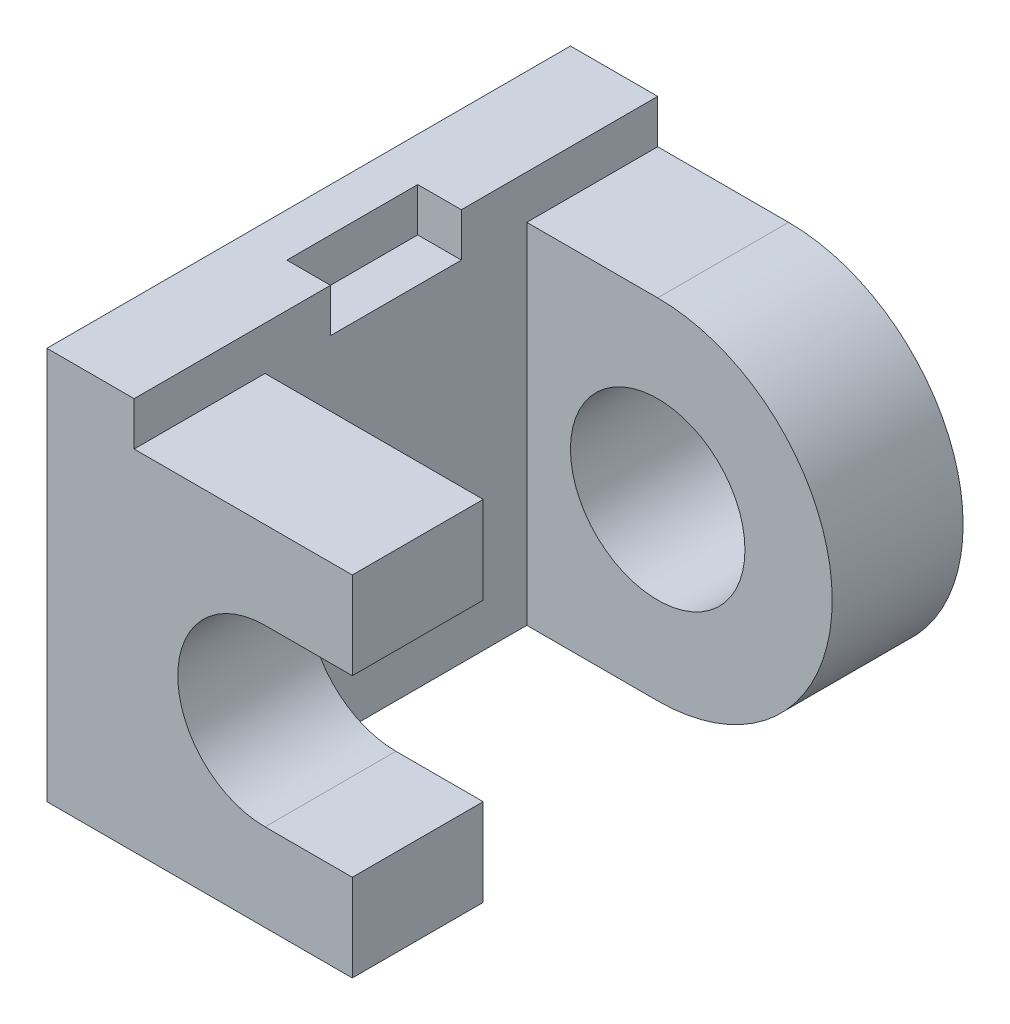
ISO-10303-21;
HEADER;
FILE_DESCRIPTION(('STEP AP214'),'2;1');
FILE_NAME('part.step','',(''),(''),'','','');
FILE_SCHEMA(('AUTOMOTIVE_DESIGN { 1 0 10303 214 1 1 1 1 }'));
ENDSEC;
DATA;
#1=APPLICATION_CONTEXT('core data for automotive mechanical design processes');
#2=APPLICATION_PROTOCOL_DEFINITION('international standard','automotive_design',2000,#1);
#3=PRODUCT_CONTEXT('',#1,'mechanical');
#4=PRODUCT('Part','Part','',(#3));
#5=PRODUCT_RELATED_PRODUCT_CATEGORY('part','',(#4));
#6=PRODUCT_DEFINITION_FORMATION('','',#4);
#7=PRODUCT_DEFINITION_CONTEXT('part definition',#1,'design');
#8=PRODUCT_DEFINITION('design','',#6,#7);
#9=PRODUCT_DEFINITION_SHAPE('','',#8);
#10=(LENGTH_UNIT() NAMED_UNIT(*) SI_UNIT(.MILLI.,.METRE.));
#11=(NAMED_UNIT(*) PLANE_ANGLE_UNIT() SI_UNIT($,.RADIAN.));
#12=(NAMED_UNIT(*) SI_UNIT($,.STERADIAN.) SOLID_ANGLE_UNIT());
#13=UNCERTAINTY_MEASURE_WITH_UNIT(LENGTH_MEASURE(1.E-05),#10,'distance_accuracy_value','');
#14=(GEOMETRIC_REPRESENTATION_CONTEXT(3) GLOBAL_UNCERTAINTY_ASSIGNED_CONTEXT((#13)) GLOBAL_UNIT_ASSIGNED_CONTEXT((#10,
#11,#12)) REPRESENTATION_CONTEXT('',''));
#15=CARTESIAN_POINT('',(0.,0.,0.));
#16=DIRECTION('',(0.,0.,1.));
#17=DIRECTION('',(1.,0.,0.));
#18=AXIS2_PLACEMENT_3D('',#15,#16,#17);
#19=CARTESIAN_POINT('',(9.,9.,-9.));
#20=DIRECTION('',(0.,0.,-1.));
#21=DIRECTION('',(-1.,0.,0.));
#22=AXIS2_PLACEMENT_3D('',#19,#20,#21);
#23=PLANE('',#22);
#24=CARTESIAN_POINT('',(5.,4.,-9.));
#25=DIRECTION('',(0.,0.,1.));
#26=DIRECTION('',(1.,0.,0.));
#27=AXIS2_PLACEMENT_3D('',#24,#25,#26);
#28=CIRCLE('',#27,2.);
#29=CARTESIAN_POINT('',(7.,4.,-9.));
#30=VERTEX_POINT('',#29);
#31=EDGE_CURVE('E273',#30,#30,#28,.T.);
#32=ORIENTED_EDGE('',*,*,#31,.F.);
#33=EDGE_LOOP('',(#32));
#34=FACE_BOUND('',#33,.T.);
#35=DIRECTION('',(1.,0.,0.));
#36=VECTOR('',#35,1.);
#37=CARTESIAN_POINT('',(9.,0.,-9.));
#38=LINE('',#37,#36);
#39=CARTESIAN_POINT('',(2.,0.,-9.));
#40=VERTEX_POINT('',#39);
#41=CARTESIAN_POINT('',(5.,0.,-9.));
#42=VERTEX_POINT('',#41);
#43=EDGE_CURVE('E220',#40,#42,#38,.T.);
#44=ORIENTED_EDGE('',*,*,#43,.T.);
#45=CARTESIAN_POINT('',(5.,4.,-9.));
#46=DIRECTION('',(0.,0.,1.));
#47=DIRECTION('',(1.,0.,0.));
#48=AXIS2_PLACEMENT_3D('',#45,#46,#47);
#49=CIRCLE('',#48,4.);
#50=CARTESIAN_POINT('',(5.,8.,-9.));
#51=VERTEX_POINT('',#50);
#52=EDGE_CURVE('E203',#51,#42,#49,.F.);
#53=ORIENTED_EDGE('',*,*,#52,.F.);
#54=DIRECTION('',(1.,0.,0.));
#55=VECTOR('',#54,1.);
#56=CARTESIAN_POINT('',(0.,8.,-9.));
#57=LINE('',#56,#55);
#58=CARTESIAN_POINT('',(2.,8.,-9.));
#59=VERTEX_POINT('',#58);
#60=EDGE_CURVE('E214',#59,#51,#57,.T.);
#61=ORIENTED_EDGE('',*,*,#60,.F.);
#62=DIRECTION('',(0.,-1.,0.));
#63=VECTOR('',#62,1.);
#64=CARTESIAN_POINT('',(2.,9.,-9.));
#65=LINE('',#64,#63);
#66=EDGE_CURVE('E224',#59,#40,#65,.T.);
#67=ORIENTED_EDGE('',*,*,#66,.T.);
#68=EDGE_LOOP('',(#44,#53,#61,#67));
#69=FACE_BOUND('',#68,.T.);
#70=ADVANCED_FACE('F78',(#34,#69),#23,.F.);
#71=CARTESIAN_POINT('',(0.,9.,-12.));
#72=DIRECTION('',(0.,0.,1.));
#73=DIRECTION('',(1.,0.,0.));
#74=AXIS2_PLACEMENT_3D('',#71,#72,#73);
#75=PLANE('',#74);
#76=CARTESIAN_POINT('',(5.,4.,-12.));
#77=DIRECTION('',(0.,0.,1.));
#78=DIRECTION('',(1.,0.,0.));
#79=AXIS2_PLACEMENT_3D('',#76,#77,#78);
#80=CIRCLE('',#79,2.);
#81=CARTESIAN_POINT('',(7.,4.,-12.));
#82=VERTEX_POINT('',#81);
#83=EDGE_CURVE('E260',#82,#82,#80,.T.);
#84=ORIENTED_EDGE('',*,*,#83,.T.);
#85=EDGE_LOOP('',(#84));
#86=FACE_BOUND('',#85,.T.);
#87=CARTESIAN_POINT('',(5.,4.,-12.));
#88=DIRECTION('',(0.,0.,1.));
#89=DIRECTION('',(1.,0.,0.));
#90=AXIS2_PLACEMENT_3D('',#87,#88,#89);
#91=CIRCLE('',#90,4.);
#92=CARTESIAN_POINT('',(5.,8.,-12.));
#93=VERTEX_POINT('',#92);
#94=CARTESIAN_POINT('',(5.,0.,-12.));
#95=VERTEX_POINT('',#94);
#96=EDGE_CURVE('E86',#93,#95,#91,.F.);
#97=ORIENTED_EDGE('',*,*,#96,.T.);
#98=DIRECTION('',(-1.,0.,0.));
#99=VECTOR('',#98,1.);
#100=CARTESIAN_POINT('',(0.,0.,-12.));
#101=LINE('',#100,#99);
#102=CARTESIAN_POINT('',(0.,0.,-12.));
#103=VERTEX_POINT('',#102);
#104=EDGE_CURVE('E222',#95,#103,#101,.T.);
#105=ORIENTED_EDGE('',*,*,#104,.T.);
#106=DIRECTION('',(0.,-1.,0.));
#107=VECTOR('',#106,1.);
#108=CARTESIAN_POINT('',(0.,9.,-12.));
#109=LINE('',#108,#107);
#110=CARTESIAN_POINT('',(0.,9.,-12.));
#111=VERTEX_POINT('',#110);
#112=EDGE_CURVE('E239',#111,#103,#109,.T.);
#113=ORIENTED_EDGE('',*,*,#112,.F.);
#114=DIRECTION('',(-1.,0.,0.));
#115=VECTOR('',#114,1.);
#116=CARTESIAN_POINT('',(0.,9.,-12.));
#117=LINE('',#116,#115);
#118=CARTESIAN_POINT('',(2.,9.,-12.));
#119=VERTEX_POINT('',#118);
#120=EDGE_CURVE('E343',#119,#111,#117,.T.);
#121=ORIENTED_EDGE('',*,*,#120,.F.);
#122=DIRECTION('',(0.,-1.,0.));
#123=VECTOR('',#122,1.);
#124=CARTESIAN_POINT('',(2.,9.,-12.));
#125=LINE('',#124,#123);
#126=CARTESIAN_POINT('',(2.,8.,-12.));
#127=VERTEX_POINT('',#126);
#128=EDGE_CURVE('E264',#119,#127,#125,.T.);
#129=ORIENTED_EDGE('',*,*,#128,.T.);
#130=DIRECTION('',(1.,0.,0.));
#131=VECTOR('',#130,1.);
#132=CARTESIAN_POINT('',(0.,8.,-12.));
#133=LINE('',#132,#131);
#134=EDGE_CURVE('E259',#127,#93,#133,.T.);
#135=ORIENTED_EDGE('',*,*,#134,.T.);
#136=EDGE_LOOP('',(#97,#105,#113,#121,#129,#135));
#137=FACE_BOUND('',#136,.T.);
#138=ADVANCED_FACE('F267',(#86,#137),#75,.F.);
#139=CARTESIAN_POINT('',(7.,9.,0.));
#140=DIRECTION('',(0.,0.,-1.));
#141=DIRECTION('',(-1.,0.,0.));
#142=AXIS2_PLACEMENT_3D('',#139,#140,#141);
#143=PLANE('',#142);
#144=DIRECTION('',(0.,-1.,0.));
#145=VECTOR('',#144,1.);
#146=CARTESIAN_POINT('',(7.,9.,0.));
#147=LINE('',#146,#145);
#148=CARTESIAN_POINT('',(7.,8.,0.));
#149=VERTEX_POINT('',#148);
#150=CARTESIAN_POINT('',(7.,6.,0.));
#151=VERTEX_POINT('',#150);
#152=EDGE_CURVE('E251',#149,#151,#147,.T.);
#153=ORIENTED_EDGE('',*,*,#152,.F.);
#154=DIRECTION('',(1.,0.,0.));
#155=VECTOR('',#154,1.);
#156=CARTESIAN_POINT('',(2.,8.,0.));
#157=LINE('',#156,#155);
#158=CARTESIAN_POINT('',(2.,8.,0.));
#159=VERTEX_POINT('',#158);
#160=EDGE_CURVE('E308',#159,#149,#157,.T.);
#161=ORIENTED_EDGE('',*,*,#160,.F.);
#162=DIRECTION('',(0.,-1.,0.));
#163=VECTOR('',#162,1.);
#164=CARTESIAN_POINT('',(2.,9.,0.));
#165=LINE('',#164,#163);
#166=CARTESIAN_POINT('',(2.,9.,0.));
#167=VERTEX_POINT('',#166);
#168=EDGE_CURVE('E310',#167,#159,#165,.T.);
#169=ORIENTED_EDGE('',*,*,#168,.F.);
#170=DIRECTION('',(1.,0.,0.));
#171=VECTOR('',#170,1.);
#172=CARTESIAN_POINT('',(7.,9.,0.));
#173=LINE('',#172,#171);
#174=CARTESIAN_POINT('',(0.,9.,0.));
#175=VERTEX_POINT('',#174);
#176=EDGE_CURVE('E235',#175,#167,#173,.T.);
#177=ORIENTED_EDGE('',*,*,#176,.F.);
#178=DIRECTION('',(0.,-1.,0.));
#179=VECTOR('',#178,1.);
#180=CARTESIAN_POINT('',(0.,9.,0.));
#181=LINE('',#180,#179);
#182=CARTESIAN_POINT('',(0.,0.,0.));
#183=VERTEX_POINT('',#182);
#184=EDGE_CURVE('E236',#175,#183,#181,.T.);
#185=ORIENTED_EDGE('',*,*,#184,.T.);
#186=DIRECTION('',(1.,0.,0.));
#187=VECTOR('',#186,1.);
#188=CARTESIAN_POINT('',(7.,0.,0.));
#189=LINE('',#188,#187);
#190=CARTESIAN_POINT('',(7.,0.,0.));
#191=VERTEX_POINT('',#190);
#192=EDGE_CURVE('E337',#183,#191,#189,.T.);
#193=ORIENTED_EDGE('',*,*,#192,.T.);
#194=CARTESIAN_POINT('',(7.,2.,0.));
#195=VERTEX_POINT('',#194);
#196=EDGE_CURVE('E249',#195,#191,#147,.T.);
#197=ORIENTED_EDGE('',*,*,#196,.F.);
#198=DIRECTION('',(-1.,0.,0.));
#199=VECTOR('',#198,1.);
#200=CARTESIAN_POINT('',(0.,2.,0.));
#201=LINE('',#200,#199);
#202=CARTESIAN_POINT('',(5.,2.,0.));
#203=VERTEX_POINT('',#202);
#204=EDGE_CURVE('E319',#195,#203,#201,.T.);
#205=ORIENTED_EDGE('',*,*,#204,.T.);
#206=CARTESIAN_POINT('',(5.,4.,0.));
#207=DIRECTION('',(0.,0.,1.));
#208=DIRECTION('',(1.,0.,0.));
#209=AXIS2_PLACEMENT_3D('',#206,#207,#208);
#210=CIRCLE('',#209,2.);
#211=CARTESIAN_POINT('',(5.,6.,0.));
#212=VERTEX_POINT('',#211);
#213=EDGE_CURVE('E323',#212,#203,#210,.T.);
#214=ORIENTED_EDGE('',*,*,#213,.F.);
#215=DIRECTION('',(1.,0.,0.));
#216=VECTOR('',#215,1.);
#217=CARTESIAN_POINT('',(0.,6.,0.));
#218=LINE('',#217,#216);
#219=EDGE_CURVE('E311',#212,#151,#218,.T.);
#220=ORIENTED_EDGE('',*,*,#219,.T.);
#221=EDGE_LOOP('',(#153,#161,#169,#177,#185,#193,#197,#205,#214,#220));
#222=FACE_BOUND('',#221,.T.);
#223=ADVANCED_FACE('F80',(#222),#143,.F.);
#224=CARTESIAN_POINT('',(7.,9.,-3.));
#225=DIRECTION('',(-1.,0.,0.));
#226=DIRECTION('',(0.,0.,1.));
#227=AXIS2_PLACEMENT_3D('',#224,#225,#226);
#228=PLANE('',#227);
#229=DIRECTION('',(0.,-1.,0.));
#230=VECTOR('',#229,1.);
#231=CARTESIAN_POINT('',(7.,9.,-3.));
#232=LINE('',#231,#230);
#233=CARTESIAN_POINT('',(7.,8.,-3.));
#234=VERTEX_POINT('',#233);
#235=CARTESIAN_POINT('',(7.,6.,-3.));
#236=VERTEX_POINT('',#235);
#237=EDGE_CURVE('E248',#234,#236,#232,.T.);
#238=ORIENTED_EDGE('',*,*,#237,.F.);
#239=DIRECTION('',(0.,0.,1.));
#240=VECTOR('',#239,1.);
#241=CARTESIAN_POINT('',(7.,8.,-3.));
#242=LINE('',#241,#240);
#243=EDGE_CURVE('E330',#234,#149,#242,.T.);
#244=ORIENTED_EDGE('',*,*,#243,.T.);
#245=ORIENTED_EDGE('',*,*,#152,.T.);
#246=DIRECTION('',(0.,0.,1.));
#247=VECTOR('',#246,1.);
#248=CARTESIAN_POINT('',(7.,6.,-3.));
#249=LINE('',#248,#247);
#250=EDGE_CURVE('E335',#236,#151,#249,.T.);
#251=ORIENTED_EDGE('',*,*,#250,.F.);
#252=EDGE_LOOP('',(#238,#244,#245,#251));
#253=FACE_BOUND('',#252,.T.);
#254=ADVANCED_FACE('F371',(#253),#228,.F.);
#255=DIRECTION('',(0.,0.,-1.));
#256=VECTOR('',#255,1.);
#257=CARTESIAN_POINT('',(7.,2.,-3.));
#258=LINE('',#257,#256);
#259=CARTESIAN_POINT('',(7.,2.,-3.));
#260=VERTEX_POINT('',#259);
#261=EDGE_CURVE('E333',#195,#260,#258,.T.);
#262=ORIENTED_EDGE('',*,*,#261,.F.);
#263=ORIENTED_EDGE('',*,*,#196,.T.);
#264=DIRECTION('',(0.,0.,-1.));
#265=VECTOR('',#264,1.);
#266=CARTESIAN_POINT('',(7.,0.,-3.));
#267=LINE('',#266,#265);
#268=CARTESIAN_POINT('',(7.,0.,-3.));
#269=VERTEX_POINT('',#268);
#270=EDGE_CURVE('E348',#191,#269,#267,.T.);
#271=ORIENTED_EDGE('',*,*,#270,.T.);
#272=EDGE_CURVE('E246',#260,#269,#232,.T.);
#273=ORIENTED_EDGE('',*,*,#272,.F.);
#274=EDGE_LOOP('',(#262,#263,#271,#273));
#275=FACE_BOUND('',#274,.T.);
#276=ADVANCED_FACE('F387',(#275),#228,.F.);
#277=CARTESIAN_POINT('',(2.,9.,-3.));
#278=DIRECTION('',(0.,0.,1.));
#279=DIRECTION('',(1.,0.,0.));
#280=AXIS2_PLACEMENT_3D('',#277,#278,#279);
#281=PLANE('',#280);
#282=DIRECTION('',(0.,-1.,0.));
#283=VECTOR('',#282,1.);
#284=CARTESIAN_POINT('',(2.,9.,-3.));
#285=LINE('',#284,#283);
#286=CARTESIAN_POINT('',(2.,8.,-3.));
#287=VERTEX_POINT('',#286);
#288=CARTESIAN_POINT('',(2.,0.,-3.));
#289=VERTEX_POINT('',#288);
#290=EDGE_CURVE('E244',#287,#289,#285,.T.);
#291=ORIENTED_EDGE('',*,*,#290,.F.);
#292=DIRECTION('',(1.,0.,0.));
#293=VECTOR('',#292,1.);
#294=CARTESIAN_POINT('',(2.,8.,-3.));
#295=LINE('',#294,#293);
#296=EDGE_CURVE('E316',#287,#234,#295,.T.);
#297=ORIENTED_EDGE('',*,*,#296,.T.);
#298=ORIENTED_EDGE('',*,*,#237,.T.);
#299=DIRECTION('',(1.,0.,0.));
#300=VECTOR('',#299,1.);
#301=CARTESIAN_POINT('',(2.,6.,-3.));
#302=LINE('',#301,#300);
#303=CARTESIAN_POINT('',(5.,6.,-3.));
#304=VERTEX_POINT('',#303);
#305=EDGE_CURVE('E257',#304,#236,#302,.T.);
#306=ORIENTED_EDGE('',*,*,#305,.F.);
#307=CARTESIAN_POINT('',(5.,4.,-3.));
#308=DIRECTION('',(0.,0.,1.));
#309=DIRECTION('',(1.,0.,0.));
#310=AXIS2_PLACEMENT_3D('',#307,#308,#309);
#311=CIRCLE('',#310,2.);
#312=CARTESIAN_POINT('',(5.,2.,-3.));
#313=VERTEX_POINT('',#312);
#314=EDGE_CURVE('E254',#304,#313,#311,.T.);
#315=ORIENTED_EDGE('',*,*,#314,.T.);
#316=DIRECTION('',(-1.,0.,0.));
#317=VECTOR('',#316,1.);
#318=CARTESIAN_POINT('',(2.,2.,-3.));
#319=LINE('',#318,#317);
#320=EDGE_CURVE('E252',#260,#313,#319,.T.);
#321=ORIENTED_EDGE('',*,*,#320,.F.);
#322=ORIENTED_EDGE('',*,*,#272,.T.);
#323=DIRECTION('',(-1.,0.,0.));
#324=VECTOR('',#323,1.);
#325=CARTESIAN_POINT('',(2.,0.,-3.));
#326=LINE('',#325,#324);
#327=EDGE_CURVE('E230',#269,#289,#326,.T.);
#328=ORIENTED_EDGE('',*,*,#327,.T.);
#329=EDGE_LOOP('',(#291,#297,#298,#306,#315,#321,#322,#328));
#330=FACE_BOUND('',#329,.T.);
#331=ADVANCED_FACE('F354',(#330),#281,.F.);
#332=CARTESIAN_POINT('',(2.,9.,-9.));
#333=DIRECTION('',(-1.,0.,0.));
#334=DIRECTION('',(0.,0.,1.));
#335=AXIS2_PLACEMENT_3D('',#332,#333,#334);
#336=PLANE('',#335);
#337=DIRECTION('',(0.,0.,-1.));
#338=VECTOR('',#337,1.);
#339=CARTESIAN_POINT('',(2.,8.,-4.5));
#340=LINE('',#339,#338);
#341=CARTESIAN_POINT('',(2.,8.,-4.5));
#342=VERTEX_POINT('',#341);
#343=CARTESIAN_POINT('',(2.,8.,-7.5));
#344=VERTEX_POINT('',#343);
#345=EDGE_CURVE('E281',#342,#344,#340,.T.);
#346=ORIENTED_EDGE('',*,*,#345,.F.);
#347=DIRECTION('',(0.,1.,0.));
#348=VECTOR('',#347,1.);
#349=CARTESIAN_POINT('',(2.,8.,-4.5));
#350=LINE('',#349,#348);
#351=CARTESIAN_POINT('',(2.,9.,-4.5));
#352=VERTEX_POINT('',#351);
#353=EDGE_CURVE('E299',#342,#352,#350,.T.);
#354=ORIENTED_EDGE('',*,*,#353,.T.);
#355=DIRECTION('',(0.,0.,-1.));
#356=VECTOR('',#355,1.);
#357=CARTESIAN_POINT('',(2.,9.,-9.));
#358=LINE('',#357,#356);
#359=EDGE_CURVE('E340',#167,#352,#358,.T.);
#360=ORIENTED_EDGE('',*,*,#359,.F.);
#361=ORIENTED_EDGE('',*,*,#168,.T.);
#362=DIRECTION('',(0.,0.,1.));
#363=VECTOR('',#362,1.);
#364=CARTESIAN_POINT('',(2.,8.,-8.));
#365=LINE('',#364,#363);
#366=EDGE_CURVE('E314',#287,#159,#365,.T.);
#367=ORIENTED_EDGE('',*,*,#366,.F.);
#368=ORIENTED_EDGE('',*,*,#290,.T.);
#369=DIRECTION('',(0.,0.,-1.));
#370=VECTOR('',#369,1.);
#371=CARTESIAN_POINT('',(2.,0.,-9.));
#372=LINE('',#371,#370);
#373=EDGE_CURVE('E226',#289,#40,#372,.T.);
#374=ORIENTED_EDGE('',*,*,#373,.T.);
#375=ORIENTED_EDGE('',*,*,#66,.F.);
#376=DIRECTION('',(0.,0.,1.));
#377=VECTOR('',#376,1.);
#378=CARTESIAN_POINT('',(2.,8.,-20.));
#379=LINE('',#378,#377);
#380=EDGE_CURVE('E213',#127,#59,#379,.T.);
#381=ORIENTED_EDGE('',*,*,#380,.F.);
#382=ORIENTED_EDGE('',*,*,#128,.F.);
#383=CARTESIAN_POINT('',(2.,9.,-7.5));
#384=VERTEX_POINT('',#383);
#385=EDGE_CURVE('E93',#384,#119,#358,.T.);
#386=ORIENTED_EDGE('',*,*,#385,.F.);
#387=DIRECTION('',(0.,1.,0.));
#388=VECTOR('',#387,1.);
#389=CARTESIAN_POINT('',(2.,8.,-7.5));
#390=LINE('',#389,#388);
#391=EDGE_CURVE('E101',#344,#384,#390,.T.);
#392=ORIENTED_EDGE('',*,*,#391,.F.);
#393=EDGE_LOOP('',(#346,#354,#360,#361,#367,#368,#374,#375,#381,#382,#386,#392));
#394=FACE_BOUND('',#393,.T.);
#395=ADVANCED_FACE('F360',(#394),#336,.F.);
#396=CARTESIAN_POINT('',(0.,9.,0.));
#397=DIRECTION('',(1.,0.,0.));
#398=DIRECTION('',(0.,0.,-1.));
#399=AXIS2_PLACEMENT_3D('',#396,#397,#398);
#400=PLANE('',#399);
#401=DIRECTION('',(0.,0.,1.));
#402=VECTOR('',#401,1.);
#403=CARTESIAN_POINT('',(0.,0.,0.));
#404=LINE('',#403,#402);
#405=EDGE_CURVE('E228',#103,#183,#404,.T.);
#406=ORIENTED_EDGE('',*,*,#405,.T.);
#407=ORIENTED_EDGE('',*,*,#184,.F.);
#408=DIRECTION('',(0.,0.,1.));
#409=VECTOR('',#408,1.);
#410=CARTESIAN_POINT('',(0.,9.,0.));
#411=LINE('',#410,#409);
#412=EDGE_CURVE('E240',#111,#175,#411,.T.);
#413=ORIENTED_EDGE('',*,*,#412,.F.);
#414=ORIENTED_EDGE('',*,*,#112,.T.);
#415=EDGE_LOOP('',(#406,#407,#413,#414));
#416=FACE_BOUND('',#415,.T.);
#417=ADVANCED_FACE('F393',(#416),#400,.F.);
#418=CARTESIAN_POINT('',(0.,9.,0.));
#419=DIRECTION('',(0.,-1.,0.));
#420=DIRECTION('',(0.,0.,-1.));
#421=AXIS2_PLACEMENT_3D('',#418,#419,#420);
#422=PLANE('',#421);
#423=ORIENTED_EDGE('',*,*,#385,.T.);
#424=ORIENTED_EDGE('',*,*,#120,.T.);
#425=ORIENTED_EDGE('',*,*,#412,.T.);
#426=ORIENTED_EDGE('',*,*,#176,.T.);
#427=ORIENTED_EDGE('',*,*,#359,.T.);
#428=DIRECTION('',(1.,0.,0.));
#429=VECTOR('',#428,1.);
#430=CARTESIAN_POINT('',(2.,9.,-4.5));
#431=LINE('',#430,#429);
#432=CARTESIAN_POINT('',(1.,9.,-4.5));
#433=VERTEX_POINT('',#432);
#434=EDGE_CURVE('E285',#433,#352,#431,.T.);
#435=ORIENTED_EDGE('',*,*,#434,.F.);
#436=DIRECTION('',(0.,0.,1.));
#437=VECTOR('',#436,1.);
#438=CARTESIAN_POINT('',(1.,9.,-4.5));
#439=LINE('',#438,#437);
#440=CARTESIAN_POINT('',(1.,9.,-7.5));
#441=VERTEX_POINT('',#440);
#442=EDGE_CURVE('E295',#441,#433,#439,.T.);
#443=ORIENTED_EDGE('',*,*,#442,.F.);
#444=DIRECTION('',(-1.,0.,0.));
#445=VECTOR('',#444,1.);
#446=CARTESIAN_POINT('',(2.,9.,-7.5));
#447=LINE('',#446,#445);
#448=EDGE_CURVE('E263',#384,#441,#447,.T.);
#449=ORIENTED_EDGE('',*,*,#448,.F.);
#450=EDGE_LOOP('',(#423,#424,#425,#426,#427,#435,#443,#449));
#451=FACE_BOUND('',#450,.T.);
#452=ADVANCED_FACE('F395',(#451),#422,.F.);
#453=CARTESIAN_POINT('',(0.,0.,0.));
#454=DIRECTION('',(0.,-1.,0.));
#455=DIRECTION('',(0.,0.,-1.));
#456=AXIS2_PLACEMENT_3D('',#453,#454,#455);
#457=PLANE('',#456);
#458=DIRECTION('',(0.,0.,1.));
#459=VECTOR('',#458,1.);
#460=CARTESIAN_POINT('',(5.,0.,-20.));
#461=LINE('',#460,#459);
#462=EDGE_CURVE('E12',#42,#95,#461,.F.);
#463=ORIENTED_EDGE('',*,*,#462,.F.);
#464=ORIENTED_EDGE('',*,*,#43,.F.);
#465=ORIENTED_EDGE('',*,*,#373,.F.);
#466=ORIENTED_EDGE('',*,*,#327,.F.);
#467=ORIENTED_EDGE('',*,*,#270,.F.);
#468=ORIENTED_EDGE('',*,*,#192,.F.);
#469=ORIENTED_EDGE('',*,*,#405,.F.);
#470=ORIENTED_EDGE('',*,*,#104,.F.);
#471=EDGE_LOOP('',(#463,#464,#465,#466,#467,#468,#469,#470));
#472=FACE_BOUND('',#471,.T.);
#473=ADVANCED_FACE('F218',(#472),#457,.T.);
#474=CARTESIAN_POINT('',(2.,8.,-8.));
#475=DIRECTION('',(0.,-1.,0.));
#476=DIRECTION('',(1.,0.,0.));
#477=AXIS2_PLACEMENT_3D('',#474,#475,#476);
#478=PLANE('',#477);
#479=ORIENTED_EDGE('',*,*,#296,.F.);
#480=ORIENTED_EDGE('',*,*,#366,.T.);
#481=ORIENTED_EDGE('',*,*,#160,.T.);
#482=ORIENTED_EDGE('',*,*,#243,.F.);
#483=EDGE_LOOP('',(#479,#480,#481,#482));
#484=FACE_BOUND('',#483,.T.);
#485=ADVANCED_FACE('F365',(#484),#478,.F.);
#486=CARTESIAN_POINT('',(5.,4.,-8.));
#487=DIRECTION('',(0.,0.,1.));
#488=DIRECTION('',(1.,0.,0.));
#489=AXIS2_PLACEMENT_3D('',#486,#487,#488);
#490=CYLINDRICAL_SURFACE('',#489,2.);
#491=DIRECTION('',(0.,0.,1.));
#492=VECTOR('',#491,1.);
#493=CARTESIAN_POINT('',(5.,6.,-8.));
#494=LINE('',#493,#492);
#495=EDGE_CURVE('E317',#304,#212,#494,.T.);
#496=ORIENTED_EDGE('',*,*,#495,.T.);
#497=ORIENTED_EDGE('',*,*,#213,.T.);
#498=DIRECTION('',(0.,0.,1.));
#499=VECTOR('',#498,1.);
#500=CARTESIAN_POINT('',(5.,2.,-8.));
#501=LINE('',#500,#499);
#502=EDGE_CURVE('E302',#313,#203,#501,.T.);
#503=ORIENTED_EDGE('',*,*,#502,.F.);
#504=ORIENTED_EDGE('',*,*,#314,.F.);
#505=EDGE_LOOP('',(#496,#497,#503,#504));
#506=FACE_BOUND('',#505,.T.);
#507=ADVANCED_FACE('F383',(#506),#490,.F.);
#508=CARTESIAN_POINT('',(0.,6.,-8.));
#509=DIRECTION('',(0.,-1.,0.));
#510=DIRECTION('',(0.,0.,-1.));
#511=AXIS2_PLACEMENT_3D('',#508,#509,#510);
#512=PLANE('',#511);
#513=ORIENTED_EDGE('',*,*,#250,.T.);
#514=ORIENTED_EDGE('',*,*,#219,.F.);
#515=ORIENTED_EDGE('',*,*,#495,.F.);
#516=ORIENTED_EDGE('',*,*,#305,.T.);
#517=EDGE_LOOP('',(#513,#514,#515,#516));
#518=FACE_BOUND('',#517,.T.);
#519=ADVANCED_FACE('F376',(#518),#512,.T.);
#520=CARTESIAN_POINT('',(0.,2.,-8.));
#521=DIRECTION('',(0.,1.,0.));
#522=DIRECTION('',(0.,0.,1.));
#523=AXIS2_PLACEMENT_3D('',#520,#521,#522);
#524=PLANE('',#523);
#525=ORIENTED_EDGE('',*,*,#261,.T.);
#526=ORIENTED_EDGE('',*,*,#320,.T.);
#527=ORIENTED_EDGE('',*,*,#502,.T.);
#528=ORIENTED_EDGE('',*,*,#204,.F.);
#529=EDGE_LOOP('',(#525,#526,#527,#528));
#530=FACE_BOUND('',#529,.T.);
#531=ADVANCED_FACE('F507',(#530),#524,.T.);
#532=CARTESIAN_POINT('',(2.,8.,-4.5));
#533=DIRECTION('',(0.,0.,1.));
#534=DIRECTION('',(1.,0.,0.));
#535=AXIS2_PLACEMENT_3D('',#532,#533,#534);
#536=PLANE('',#535);
#537=ORIENTED_EDGE('',*,*,#434,.T.);
#538=ORIENTED_EDGE('',*,*,#353,.F.);
#539=DIRECTION('',(1.,0.,0.));
#540=VECTOR('',#539,1.);
#541=CARTESIAN_POINT('',(2.,8.,-4.5));
#542=LINE('',#541,#540);
#543=CARTESIAN_POINT('',(1.,8.,-4.5));
#544=VERTEX_POINT('',#543);
#545=EDGE_CURVE('E291',#544,#342,#542,.T.);
#546=ORIENTED_EDGE('',*,*,#545,.F.);
#547=DIRECTION('',(0.,1.,0.));
#548=VECTOR('',#547,1.);
#549=CARTESIAN_POINT('',(1.,8.,-4.5));
#550=LINE('',#549,#548);
#551=EDGE_CURVE('E303',#544,#433,#550,.T.);
#552=ORIENTED_EDGE('',*,*,#551,.T.);
#553=EDGE_LOOP('',(#537,#538,#546,#552));
#554=FACE_BOUND('',#553,.T.);
#555=ADVANCED_FACE('F400',(#554),#536,.F.);
#556=CARTESIAN_POINT('',(1.,8.,-4.5));
#557=DIRECTION('',(-1.,0.,0.));
#558=DIRECTION('',(0.,0.,1.));
#559=AXIS2_PLACEMENT_3D('',#556,#557,#558);
#560=PLANE('',#559);
#561=ORIENTED_EDGE('',*,*,#442,.T.);
#562=ORIENTED_EDGE('',*,*,#551,.F.);
#563=DIRECTION('',(0.,0.,1.));
#564=VECTOR('',#563,1.);
#565=CARTESIAN_POINT('',(1.,8.,-4.5));
#566=LINE('',#565,#564);
#567=CARTESIAN_POINT('',(1.,8.,-7.5));
#568=VERTEX_POINT('',#567);
#569=EDGE_CURVE('E288',#568,#544,#566,.T.);
#570=ORIENTED_EDGE('',*,*,#569,.F.);
#571=DIRECTION('',(0.,1.,0.));
#572=VECTOR('',#571,1.);
#573=CARTESIAN_POINT('',(1.,8.,-7.5));
#574=LINE('',#573,#572);
#575=EDGE_CURVE('E305',#568,#441,#574,.T.);
#576=ORIENTED_EDGE('',*,*,#575,.T.);
#577=EDGE_LOOP('',(#561,#562,#570,#576));
#578=FACE_BOUND('',#577,.T.);
#579=ADVANCED_FACE('F405',(#578),#560,.F.);
#580=CARTESIAN_POINT('',(2.,8.,-7.5));
#581=DIRECTION('',(0.,0.,-1.));
#582=DIRECTION('',(-1.,0.,0.));
#583=AXIS2_PLACEMENT_3D('',#580,#581,#582);
#584=PLANE('',#583);
#585=ORIENTED_EDGE('',*,*,#448,.T.);
#586=ORIENTED_EDGE('',*,*,#575,.F.);
#587=DIRECTION('',(-1.,0.,0.));
#588=VECTOR('',#587,1.);
#589=CARTESIAN_POINT('',(2.,8.,-7.5));
#590=LINE('',#589,#588);
#591=EDGE_CURVE('E284',#344,#568,#590,.T.);
#592=ORIENTED_EDGE('',*,*,#591,.F.);
#593=ORIENTED_EDGE('',*,*,#391,.T.);
#594=EDGE_LOOP('',(#585,#586,#592,#593));
#595=FACE_BOUND('',#594,.T.);
#596=ADVANCED_FACE('F406',(#595),#584,.F.);
#597=CARTESIAN_POINT('',(0.,8.,0.));
#598=DIRECTION('',(0.,1.,0.));
#599=DIRECTION('',(0.,0.,1.));
#600=AXIS2_PLACEMENT_3D('',#597,#598,#599);
#601=PLANE('',#600);
#602=ORIENTED_EDGE('',*,*,#345,.T.);
#603=ORIENTED_EDGE('',*,*,#591,.T.);
#604=ORIENTED_EDGE('',*,*,#569,.T.);
#605=ORIENTED_EDGE('',*,*,#545,.T.);
#606=EDGE_LOOP('',(#602,#603,#604,#605));
#607=FACE_BOUND('',#606,.T.);
#608=ADVANCED_FACE('F402',(#607),#601,.T.);
#609=CARTESIAN_POINT('',(5.,4.,-20.));
#610=DIRECTION('',(0.,0.,1.));
#611=DIRECTION('',(1.,0.,0.));
#612=AXIS2_PLACEMENT_3D('',#609,#610,#611);
#613=CYLINDRICAL_SURFACE('',#612,4.);
#614=DIRECTION('',(0.,0.,1.));
#615=VECTOR('',#614,1.);
#616=CARTESIAN_POINT('',(5.,8.,-20.));
#617=LINE('',#616,#615);
#618=EDGE_CURVE('E208',#93,#51,#617,.T.);
#619=ORIENTED_EDGE('',*,*,#618,.T.);
#620=ORIENTED_EDGE('',*,*,#52,.T.);
#621=ORIENTED_EDGE('',*,*,#462,.T.);
#622=ORIENTED_EDGE('',*,*,#96,.F.);
#623=EDGE_LOOP('',(#619,#620,#621,#622));
#624=FACE_BOUND('',#623,.T.);
#625=ADVANCED_FACE('F205',(#624),#613,.T.);
#626=CARTESIAN_POINT('',(0.,8.,-20.));
#627=DIRECTION('',(0.,-1.,0.));
#628=DIRECTION('',(0.,0.,-1.));
#629=AXIS2_PLACEMENT_3D('',#626,#627,#628);
#630=PLANE('',#629);
#631=ORIENTED_EDGE('',*,*,#380,.T.);
#632=ORIENTED_EDGE('',*,*,#60,.T.);
#633=ORIENTED_EDGE('',*,*,#618,.F.);
#634=ORIENTED_EDGE('',*,*,#134,.F.);
#635=EDGE_LOOP('',(#631,#632,#633,#634));
#636=FACE_BOUND('',#635,.T.);
#637=ADVANCED_FACE('F271',(#636),#630,.F.);
#638=CARTESIAN_POINT('',(5.,4.,-20.));
#639=DIRECTION('',(0.,0.,1.));
#640=DIRECTION('',(1.,0.,0.));
#641=AXIS2_PLACEMENT_3D('',#638,#639,#640);
#642=CYLINDRICAL_SURFACE('',#641,2.);
#643=ORIENTED_EDGE('',*,*,#31,.T.);
#644=EDGE_LOOP('',(#643));
#645=FACE_BOUND('',#644,.T.);
#646=ORIENTED_EDGE('',*,*,#83,.F.);
#647=EDGE_LOOP('',(#646));
#648=FACE_BOUND('',#647,.T.);
#649=ADVANCED_FACE('F491',(#645,#648),#642,.F.);
#650=CLOSED_SHELL('',(#70,#138,#223,#254,#276,#331,#395,#417,#452,#473,#485,#507,#519,#531,#555,
#579,#596,#608,#625,#637,#649));
#651=MANIFOLD_SOLID_BREP('B2',#650);
#652=ADVANCED_BREP_SHAPE_REPRESENTATION('',(#18,#651),#14);
#653=SHAPE_DEFINITION_REPRESENTATION(#9,#652);
ENDSEC;
END-ISO-10303-21;
